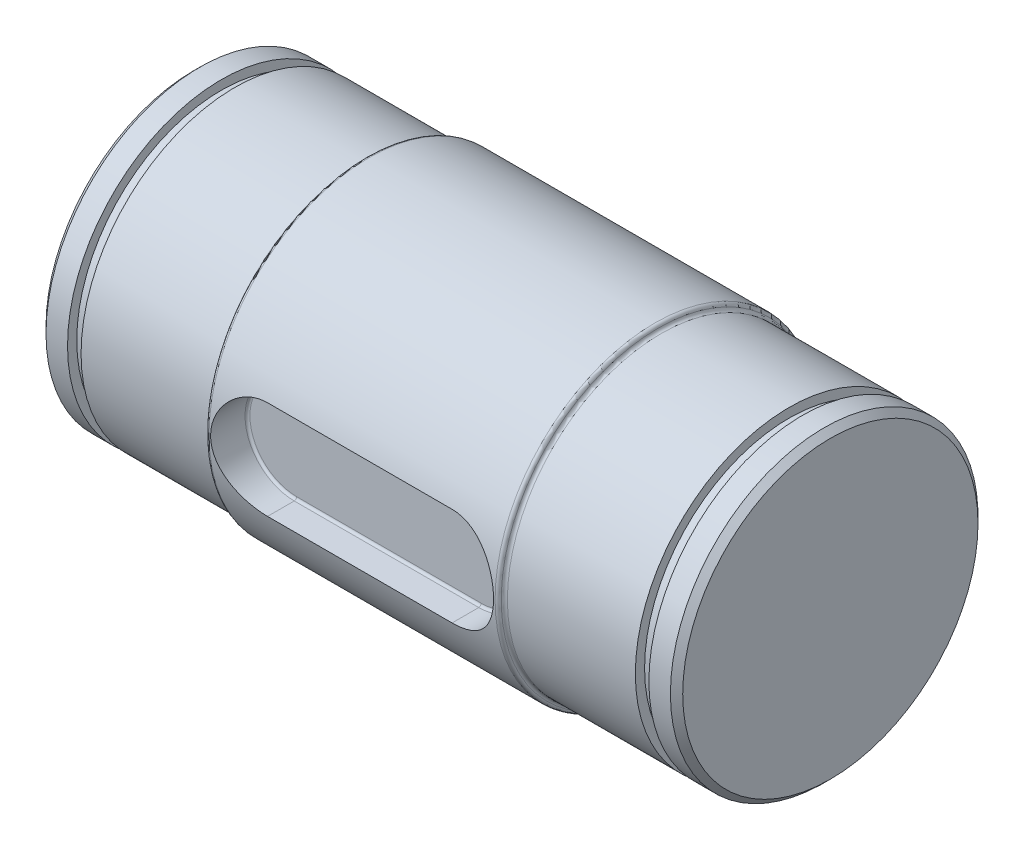
ISO-10303-21;
HEADER;
FILE_DESCRIPTION(('STEP AP214'),'2;1');
FILE_NAME('part.step','',(''),(''),'','','');
FILE_SCHEMA(('AUTOMOTIVE_DESIGN { 1 0 10303 214 1 1 1 1 }'));
ENDSEC;
DATA;
#1=APPLICATION_CONTEXT('core data for automotive mechanical design processes');
#2=APPLICATION_PROTOCOL_DEFINITION('international standard','automotive_design',2000,#1);
#3=PRODUCT_CONTEXT('',#1,'mechanical');
#4=PRODUCT('Part','Part','',(#3));
#5=PRODUCT_RELATED_PRODUCT_CATEGORY('part','',(#4));
#6=PRODUCT_DEFINITION_FORMATION('','',#4);
#7=PRODUCT_DEFINITION_CONTEXT('part definition',#1,'design');
#8=PRODUCT_DEFINITION('design','',#6,#7);
#9=PRODUCT_DEFINITION_SHAPE('','',#8);
#10=(LENGTH_UNIT() NAMED_UNIT(*) SI_UNIT(.MILLI.,.METRE.));
#11=(NAMED_UNIT(*) PLANE_ANGLE_UNIT() SI_UNIT($,.RADIAN.));
#12=(NAMED_UNIT(*) SI_UNIT($,.STERADIAN.) SOLID_ANGLE_UNIT());
#13=UNCERTAINTY_MEASURE_WITH_UNIT(LENGTH_MEASURE(1.E-05),#10,'distance_accuracy_value','');
#14=(GEOMETRIC_REPRESENTATION_CONTEXT(3) GLOBAL_UNCERTAINTY_ASSIGNED_CONTEXT((#13)) GLOBAL_UNIT_ASSIGNED_CONTEXT((#10,
#11,#12)) REPRESENTATION_CONTEXT('',''));
#15=CARTESIAN_POINT('',(0.,0.,0.));
#16=DIRECTION('',(0.,0.,1.));
#17=DIRECTION('',(1.,0.,0.));
#18=AXIS2_PLACEMENT_3D('',#15,#16,#17);
#19=CARTESIAN_POINT('',(51.75,0.,0.));
#20=DIRECTION('',(-1.,0.,0.));
#21=DIRECTION('',(0.,0.,1.));
#22=AXIS2_PLACEMENT_3D('',#19,#20,#21);
#23=PLANE('',#22);
#24=CARTESIAN_POINT('',(51.75,0.,0.));
#25=DIRECTION('',(-1.,0.,0.));
#26=DIRECTION('',(0.,0.,1.));
#27=AXIS2_PLACEMENT_3D('',#24,#25,#26);
#28=CIRCLE('',#27,24.000008612981);
#29=CARTESIAN_POINT('',(51.75,0.,24.000008612981));
#30=VERTEX_POINT('',#29);
#31=EDGE_CURVE('E20',#30,#30,#28,.T.);
#32=ORIENTED_EDGE('',*,*,#31,.F.);
#33=EDGE_LOOP('',(#32));
#34=FACE_BOUND('',#33,.T.);
#35=ADVANCED_FACE('F17',(#34),#23,.F.);
#36=CARTESIAN_POINT('',(-51.75,0.,0.));
#37=DIRECTION('',(-1.,0.,0.));
#38=DIRECTION('',(0.,0.,1.));
#39=AXIS2_PLACEMENT_3D('',#36,#37,#38);
#40=PLANE('',#39);
#41=CARTESIAN_POINT('',(-51.75,0.,1.20553902987361E-13));
#42=DIRECTION('',(-1.,0.,0.));
#43=DIRECTION('',(0.,0.,1.));
#44=AXIS2_PLACEMENT_3D('',#41,#42,#43);
#45=CIRCLE('',#44,24.0000096194053);
#46=CARTESIAN_POINT('',(-51.75,0.,24.0000096194054));
#47=VERTEX_POINT('',#46);
#48=EDGE_CURVE('E185',#47,#47,#45,.F.);
#49=ORIENTED_EDGE('',*,*,#48,.F.);
#50=EDGE_LOOP('',(#49));
#51=FACE_BOUND('',#50,.T.);
#52=ADVANCED_FACE('F422',(#51),#40,.T.);
#53=CARTESIAN_POINT('',(50.7500044859261,0.,0.));
#54=DIRECTION('',(-1.,0.,0.));
#55=DIRECTION('',(0.,0.,1.));
#56=AXIS2_PLACEMENT_3D('',#53,#54,#55);
#57=CONICAL_SURFACE('',#56,25.0000044859245,0.785398342833002);
#58=ORIENTED_EDGE('',*,*,#31,.T.);
#59=EDGE_LOOP('',(#58));
#60=FACE_BOUND('',#59,.T.);
#61=CARTESIAN_POINT('',(50.7500044865,0.,0.));
#62=DIRECTION('',(-1.,0.,0.));
#63=DIRECTION('',(0.,0.,1.));
#64=AXIS2_PLACEMENT_3D('',#61,#62,#63);
#65=CIRCLE('',#64,25.);
#66=CARTESIAN_POINT('',(50.7500044865,0.,25.));
#67=VERTEX_POINT('',#66);
#68=EDGE_CURVE('E181',#67,#67,#65,.T.);
#69=ORIENTED_EDGE('',*,*,#68,.F.);
#70=EDGE_LOOP('',(#69));
#71=FACE_BOUND('',#70,.T.);
#72=ADVANCED_FACE('F414',(#60,#71),#57,.T.);
#73=CARTESIAN_POINT('',(-50.7500050101063,0.,1.20301066671185E-13));
#74=DIRECTION('',(1.,0.,0.));
#75=DIRECTION('',(0.,0.,-1.));
#76=AXIS2_PLACEMENT_3D('',#73,#74,#75);
#77=CONICAL_SURFACE('',#76,25.0000050101042,0.785398363801);
#78=CARTESIAN_POINT('',(-50.7500100202085,0.,1.20301065975894E-13));
#79=DIRECTION('',(1.,0.,0.));
#80=DIRECTION('',(0.,0.,-1.));
#81=AXIS2_PLACEMENT_3D('',#78,#79,#80);
#82=CIRCLE('',#81,25.);
#83=CARTESIAN_POINT('',(-50.7500100202085,0.,-24.9999999999999));
#84=VERTEX_POINT('',#83);
#85=EDGE_CURVE('E184',#84,#84,#82,.T.);
#86=ORIENTED_EDGE('',*,*,#85,.F.);
#87=EDGE_LOOP('',(#86));
#88=FACE_BOUND('',#87,.T.);
#89=ORIENTED_EDGE('',*,*,#48,.T.);
#90=EDGE_LOOP('',(#89));
#91=FACE_BOUND('',#90,.T.);
#92=ADVANCED_FACE('F406',(#88,#91),#77,.T.);
#93=CARTESIAN_POINT('',(56.925,0.,0.));
#94=DIRECTION('',(-1.,0.,0.));
#95=DIRECTION('',(0.,0.,1.));
#96=AXIS2_PLACEMENT_3D('',#93,#94,#95);
#97=CYLINDRICAL_SURFACE('',#96,25.);
#98=CARTESIAN_POINT('',(47.25,0.,0.));
#99=DIRECTION('',(-1.,0.,0.));
#100=DIRECTION('',(0.,0.,1.));
#101=AXIS2_PLACEMENT_3D('',#98,#99,#100);
#102=CIRCLE('',#101,25.);
#103=CARTESIAN_POINT('',(47.25,0.,25.));
#104=VERTEX_POINT('',#103);
#105=EDGE_CURVE('E524',#104,#104,#102,.T.);
#106=ORIENTED_EDGE('',*,*,#105,.F.);
#107=EDGE_LOOP('',(#106));
#108=FACE_BOUND('',#107,.T.);
#109=ORIENTED_EDGE('',*,*,#68,.T.);
#110=EDGE_LOOP('',(#109));
#111=FACE_BOUND('',#110,.T.);
#112=ADVANCED_FACE('F398',(#108,#111),#97,.T.);
#113=CARTESIAN_POINT('',(56.925,0.,0.));
#114=DIRECTION('',(-1.,0.,0.));
#115=DIRECTION('',(0.,0.,1.));
#116=AXIS2_PLACEMENT_3D('',#113,#114,#115);
#117=CYLINDRICAL_SURFACE('',#116,25.);
#118=CARTESIAN_POINT('',(-47.25,0.,0.));
#119=DIRECTION('',(-1.,0.,0.));
#120=DIRECTION('',(0.,0.,1.));
#121=AXIS2_PLACEMENT_3D('',#118,#119,#120);
#122=CIRCLE('',#121,25.);
#123=CARTESIAN_POINT('',(-47.25,0.,25.));
#124=VERTEX_POINT('',#123);
#125=EDGE_CURVE('E527',#124,#124,#122,.T.);
#126=ORIENTED_EDGE('',*,*,#125,.T.);
#127=EDGE_LOOP('',(#126));
#128=FACE_BOUND('',#127,.T.);
#129=ORIENTED_EDGE('',*,*,#85,.T.);
#130=EDGE_LOOP('',(#129));
#131=FACE_BOUND('',#130,.T.);
#132=ADVANCED_FACE('F390',(#128,#131),#117,.T.);
#133=CARTESIAN_POINT('',(47.25,0.,0.));
#134=DIRECTION('',(-1.,0.,0.));
#135=DIRECTION('',(0.,0.,1.));
#136=AXIS2_PLACEMENT_3D('',#133,#134,#135);
#137=PLANE('',#136);
#138=CARTESIAN_POINT('',(47.25,0.,0.));
#139=DIRECTION('',(-1.,0.,0.));
#140=DIRECTION('',(0.,0.,1.));
#141=AXIS2_PLACEMENT_3D('',#138,#139,#140);
#142=CIRCLE('',#141,23.5);
#143=CARTESIAN_POINT('',(47.25,0.,23.5));
#144=VERTEX_POINT('',#143);
#145=EDGE_CURVE('E530',#144,#144,#142,.T.);
#146=ORIENTED_EDGE('',*,*,#145,.F.);
#147=EDGE_LOOP('',(#146));
#148=FACE_BOUND('',#147,.T.);
#149=ORIENTED_EDGE('',*,*,#105,.T.);
#150=EDGE_LOOP('',(#149));
#151=FACE_BOUND('',#150,.T.);
#152=ADVANCED_FACE('F382',(#148,#151),#137,.T.);
#153=CARTESIAN_POINT('',(-47.25,0.,0.));
#154=DIRECTION('',(-1.,0.,0.));
#155=DIRECTION('',(0.,0.,1.));
#156=AXIS2_PLACEMENT_3D('',#153,#154,#155);
#157=PLANE('',#156);
#158=CARTESIAN_POINT('',(-47.25,0.,0.));
#159=DIRECTION('',(-1.,0.,0.));
#160=DIRECTION('',(0.,0.,1.));
#161=AXIS2_PLACEMENT_3D('',#158,#159,#160);
#162=CIRCLE('',#161,23.5);
#163=CARTESIAN_POINT('',(-47.25,0.,23.5));
#164=VERTEX_POINT('',#163);
#165=EDGE_CURVE('E533',#164,#164,#162,.F.);
#166=ORIENTED_EDGE('',*,*,#165,.F.);
#167=EDGE_LOOP('',(#166));
#168=FACE_BOUND('',#167,.T.);
#169=ORIENTED_EDGE('',*,*,#125,.F.);
#170=EDGE_LOOP('',(#169));
#171=FACE_BOUND('',#170,.T.);
#172=ADVANCED_FACE('F374',(#168,#171),#157,.F.);
#173=CARTESIAN_POINT('',(56.925,0.,0.));
#174=DIRECTION('',(-1.,0.,0.));
#175=DIRECTION('',(0.,0.,1.));
#176=AXIS2_PLACEMENT_3D('',#173,#174,#175);
#177=CYLINDRICAL_SURFACE('',#176,23.5);
#178=CARTESIAN_POINT('',(45.05,0.,0.));
#179=DIRECTION('',(-1.,0.,0.));
#180=DIRECTION('',(0.,0.,1.));
#181=AXIS2_PLACEMENT_3D('',#178,#179,#180);
#182=CIRCLE('',#181,23.5);
#183=CARTESIAN_POINT('',(45.05,0.,23.5));
#184=VERTEX_POINT('',#183);
#185=EDGE_CURVE('E536',#184,#184,#182,.F.);
#186=ORIENTED_EDGE('',*,*,#185,.T.);
#187=EDGE_LOOP('',(#186));
#188=FACE_BOUND('',#187,.T.);
#189=ORIENTED_EDGE('',*,*,#145,.T.);
#190=EDGE_LOOP('',(#189));
#191=FACE_BOUND('',#190,.T.);
#192=ADVANCED_FACE('F366',(#188,#191),#177,.T.);
#193=CARTESIAN_POINT('',(56.925,0.,0.));
#194=DIRECTION('',(-1.,0.,0.));
#195=DIRECTION('',(0.,0.,1.));
#196=AXIS2_PLACEMENT_3D('',#193,#194,#195);
#197=CYLINDRICAL_SURFACE('',#196,23.5);
#198=ORIENTED_EDGE('',*,*,#165,.T.);
#199=EDGE_LOOP('',(#198));
#200=FACE_BOUND('',#199,.T.);
#201=CARTESIAN_POINT('',(-45.05,0.,0.));
#202=DIRECTION('',(-1.,0.,0.));
#203=DIRECTION('',(0.,0.,1.));
#204=AXIS2_PLACEMENT_3D('',#201,#202,#203);
#205=CIRCLE('',#204,23.5);
#206=CARTESIAN_POINT('',(-45.05,0.,23.5));
#207=VERTEX_POINT('',#206);
#208=EDGE_CURVE('E539',#207,#207,#205,.F.);
#209=ORIENTED_EDGE('',*,*,#208,.F.);
#210=EDGE_LOOP('',(#209));
#211=FACE_BOUND('',#210,.T.);
#212=ADVANCED_FACE('F358',(#200,#211),#197,.T.);
#213=CARTESIAN_POINT('',(45.05,0.,0.));
#214=DIRECTION('',(-1.,0.,0.));
#215=DIRECTION('',(0.,0.,1.));
#216=AXIS2_PLACEMENT_3D('',#213,#214,#215);
#217=PLANE('',#216);
#218=ORIENTED_EDGE('',*,*,#185,.F.);
#219=EDGE_LOOP('',(#218));
#220=FACE_BOUND('',#219,.T.);
#221=CARTESIAN_POINT('',(45.05,0.,0.));
#222=DIRECTION('',(-1.,0.,0.));
#223=DIRECTION('',(0.,0.,1.));
#224=AXIS2_PLACEMENT_3D('',#221,#222,#223);
#225=CIRCLE('',#224,25.);
#226=CARTESIAN_POINT('',(45.05,0.,25.));
#227=VERTEX_POINT('',#226);
#228=EDGE_CURVE('E89',#227,#227,#225,.T.);
#229=ORIENTED_EDGE('',*,*,#228,.F.);
#230=EDGE_LOOP('',(#229));
#231=FACE_BOUND('',#230,.T.);
#232=ADVANCED_FACE('F350',(#220,#231),#217,.F.);
#233=CARTESIAN_POINT('',(-45.05,0.,0.));
#234=DIRECTION('',(-1.,0.,0.));
#235=DIRECTION('',(0.,0.,1.));
#236=AXIS2_PLACEMENT_3D('',#233,#234,#235);
#237=PLANE('',#236);
#238=ORIENTED_EDGE('',*,*,#208,.T.);
#239=EDGE_LOOP('',(#238));
#240=FACE_BOUND('',#239,.T.);
#241=CARTESIAN_POINT('',(-45.05,0.,0.));
#242=DIRECTION('',(-1.,0.,0.));
#243=DIRECTION('',(0.,0.,1.));
#244=AXIS2_PLACEMENT_3D('',#241,#242,#243);
#245=CIRCLE('',#244,25.);
#246=CARTESIAN_POINT('',(-45.05,0.,25.));
#247=VERTEX_POINT('',#246);
#248=EDGE_CURVE('E88',#247,#247,#245,.F.);
#249=ORIENTED_EDGE('',*,*,#248,.F.);
#250=EDGE_LOOP('',(#249));
#251=FACE_BOUND('',#250,.T.);
#252=ADVANCED_FACE('F342',(#240,#251),#237,.T.);
#253=CARTESIAN_POINT('',(56.925,0.,0.));
#254=DIRECTION('',(-1.,0.,0.));
#255=DIRECTION('',(0.,0.,1.));
#256=AXIS2_PLACEMENT_3D('',#253,#254,#255);
#257=CYLINDRICAL_SURFACE('',#256,25.);
#258=ORIENTED_EDGE('',*,*,#228,.T.);
#259=EDGE_LOOP('',(#258));
#260=FACE_BOUND('',#259,.T.);
#261=CARTESIAN_POINT('',(24.25,0.,0.));
#262=DIRECTION('',(-1.,0.,0.));
#263=DIRECTION('',(0.,1.,-5.23143334208E-12));
#264=AXIS2_PLACEMENT_3D('',#261,#262,#263);
#265=CIRCLE('',#264,25.);
#266=CARTESIAN_POINT('',(24.25,25.,-1.30776526629399E-10));
#267=VERTEX_POINT('',#266);
#268=EDGE_CURVE('E178',#267,#267,#265,.F.);
#269=ORIENTED_EDGE('',*,*,#268,.T.);
#270=EDGE_LOOP('',(#269));
#271=FACE_BOUND('',#270,.T.);
#272=ADVANCED_FACE('F336',(#260,#271),#257,.T.);
#273=CARTESIAN_POINT('',(0.,0.,20.));
#274=DIRECTION('',(0.,0.,1.));
#275=DIRECTION('',(1.,0.,0.));
#276=AXIS2_PLACEMENT_3D('',#273,#274,#275);
#277=PLANE('',#276);
#278=DIRECTION('',(1.,0.,0.));
#279=VECTOR('',#278,1.);
#280=CARTESIAN_POINT('',(-15.2773739955,7.6,20.));
#281=LINE('',#280,#279);
#282=CARTESIAN_POINT('',(15.,7.6,20.));
#283=VERTEX_POINT('',#282);
#284=CARTESIAN_POINT('',(-15.,7.6,20.));
#285=VERTEX_POINT('',#284);
#286=EDGE_CURVE('E77',#283,#285,#281,.F.);
#287=ORIENTED_EDGE('',*,*,#286,.T.);
#288=CARTESIAN_POINT('',(-15.,0.,20.));
#289=DIRECTION('',(0.,0.,-1.));
#290=DIRECTION('',(0.,-1.,0.));
#291=AXIS2_PLACEMENT_3D('',#288,#289,#290);
#292=CIRCLE('',#291,7.6);
#293=CARTESIAN_POINT('',(-15.,-7.6,20.));
#294=VERTEX_POINT('',#293);
#295=EDGE_CURVE('E81',#285,#294,#292,.F.);
#296=ORIENTED_EDGE('',*,*,#295,.T.);
#297=DIRECTION('',(-1.,0.,0.));
#298=VECTOR('',#297,1.);
#299=CARTESIAN_POINT('',(15.2773739955,-7.6,20.));
#300=LINE('',#299,#298);
#301=CARTESIAN_POINT('',(15.,-7.6,20.));
#302=VERTEX_POINT('',#301);
#303=EDGE_CURVE('E144',#294,#302,#300,.F.);
#304=ORIENTED_EDGE('',*,*,#303,.T.);
#305=CARTESIAN_POINT('',(15.,0.,20.));
#306=DIRECTION('',(0.,0.,-1.));
#307=DIRECTION('',(0.,1.,0.));
#308=AXIS2_PLACEMENT_3D('',#305,#306,#307);
#309=CIRCLE('',#308,7.6);
#310=EDGE_CURVE('E84',#302,#283,#309,.F.);
#311=ORIENTED_EDGE('',*,*,#310,.T.);
#312=EDGE_LOOP('',(#287,#296,#304,#311));
#313=FACE_BOUND('',#312,.T.);
#314=ADVANCED_FACE('F79',(#313),#277,.T.);
#315=CARTESIAN_POINT('',(-15.2773739955,7.6,20.4));
#316=DIRECTION('',(1.,0.,0.));
#317=DIRECTION('',(0.,0.,-1.));
#318=AXIS2_PLACEMENT_3D('',#315,#316,#317);
#319=CYLINDRICAL_SURFACE('',#318,0.4);
#320=DIRECTION('',(1.,0.,0.));
#321=VECTOR('',#320,1.);
#322=CARTESIAN_POINT('',(15.,8.,20.4));
#323=LINE('',#322,#321);
#324=CARTESIAN_POINT('',(15.,8.,20.4));
#325=VERTEX_POINT('',#324);
#326=CARTESIAN_POINT('',(-15.,8.,20.4));
#327=VERTEX_POINT('',#326);
#328=EDGE_CURVE('E95',#325,#327,#323,.F.);
#329=ORIENTED_EDGE('',*,*,#328,.T.);
#330=CARTESIAN_POINT('',(-15.,7.6,20.4));
#331=DIRECTION('',(-1.,0.,0.));
#332=DIRECTION('',(0.,1.,0.));
#333=AXIS2_PLACEMENT_3D('',#330,#331,#332);
#334=CIRCLE('',#333,0.4);
#335=EDGE_CURVE('E92',#327,#285,#334,.T.);
#336=ORIENTED_EDGE('',*,*,#335,.T.);
#337=ORIENTED_EDGE('',*,*,#286,.F.);
#338=CARTESIAN_POINT('',(15.,7.6,20.4));
#339=DIRECTION('',(-1.,0.,0.));
#340=DIRECTION('',(0.,1.,0.));
#341=AXIS2_PLACEMENT_3D('',#338,#339,#340);
#342=CIRCLE('',#341,0.4);
#343=EDGE_CURVE('E149',#283,#325,#342,.F.);
#344=ORIENTED_EDGE('',*,*,#343,.T.);
#345=EDGE_LOOP('',(#329,#336,#337,#344));
#346=FACE_BOUND('',#345,.T.);
#347=ADVANCED_FACE('F93',(#346),#319,.F.);
#348=CARTESIAN_POINT('',(56.925,0.,0.));
#349=DIRECTION('',(-1.,0.,0.));
#350=DIRECTION('',(0.,0.,1.));
#351=AXIS2_PLACEMENT_3D('',#348,#349,#350);
#352=CYLINDRICAL_SURFACE('',#351,25.);
#353=ORIENTED_EDGE('',*,*,#248,.T.);
#354=EDGE_LOOP('',(#353));
#355=FACE_BOUND('',#354,.T.);
#356=CARTESIAN_POINT('',(-24.25,0.,0.));
#357=DIRECTION('',(-1.,0.,0.));
#358=DIRECTION('',(0.,1.,9.13429921978E-13));
#359=AXIS2_PLACEMENT_3D('',#356,#357,#358);
#360=CIRCLE('',#359,25.);
#361=CARTESIAN_POINT('',(-24.25,25.,2.28391156312348E-11));
#362=VERTEX_POINT('',#361);
#363=EDGE_CURVE('E175',#362,#362,#360,.T.);
#364=ORIENTED_EDGE('',*,*,#363,.T.);
#365=EDGE_LOOP('',(#364));
#366=FACE_BOUND('',#365,.T.);
#367=ADVANCED_FACE('F317',(#355,#366),#352,.T.);
#368=CARTESIAN_POINT('',(24.25,0.,0.));
#369=DIRECTION('',(-1.,0.,0.));
#370=DIRECTION('',(0.,1.,-5.23143334208E-12));
#371=AXIS2_PLACEMENT_3D('',#368,#369,#370);
#372=TOROIDAL_SURFACE('',#371,25.5,0.5);
#373=ORIENTED_EDGE('',*,*,#268,.F.);
#374=EDGE_LOOP('',(#373));
#375=FACE_BOUND('',#374,.T.);
#376=CARTESIAN_POINT('',(23.75,0.,0.));
#377=DIRECTION('',(-1.,0.,0.));
#378=DIRECTION('',(0.,1.,-1.54597272484E-11));
#379=AXIS2_PLACEMENT_3D('',#376,#377,#378);
#380=CIRCLE('',#379,25.5);
#381=CARTESIAN_POINT('',(23.75,25.5,-3.94213799141917E-10));
#382=VERTEX_POINT('',#381);
#383=EDGE_CURVE('E140',#382,#382,#380,.T.);
#384=ORIENTED_EDGE('',*,*,#383,.F.);
#385=EDGE_LOOP('',(#384));
#386=FACE_BOUND('',#385,.T.);
#387=ADVANCED_FACE('F155',(#375,#386),#372,.F.);
#388=CARTESIAN_POINT('',(15.,0.,20.4));
#389=DIRECTION('',(0.,0.,1.));
#390=DIRECTION('',(-1.,-1.01712284428E-10,0.));
#391=AXIS2_PLACEMENT_3D('',#388,#389,#390);
#392=TOROIDAL_SURFACE('',#391,7.6,0.4);
#393=CARTESIAN_POINT('',(15.,0.,20.4));
#394=DIRECTION('',(0.,0.,1.));
#395=DIRECTION('',(1.,0.,0.));
#396=AXIS2_PLACEMENT_3D('',#393,#394,#395);
#397=CIRCLE('',#396,8.);
#398=CARTESIAN_POINT('',(15.,-8.,20.4));
#399=VERTEX_POINT('',#398);
#400=EDGE_CURVE('E136',#399,#325,#397,.T.);
#401=ORIENTED_EDGE('',*,*,#400,.T.);
#402=ORIENTED_EDGE('',*,*,#343,.F.);
#403=ORIENTED_EDGE('',*,*,#310,.F.);
#404=CARTESIAN_POINT('',(15.,-7.6,20.4));
#405=DIRECTION('',(-1.,0.,0.));
#406=DIRECTION('',(0.,0.,1.));
#407=AXIS2_PLACEMENT_3D('',#404,#405,#406);
#408=CIRCLE('',#407,0.4);
#409=EDGE_CURVE('E101',#302,#399,#408,.T.);
#410=ORIENTED_EDGE('',*,*,#409,.T.);
#411=EDGE_LOOP('',(#401,#402,#403,#410));
#412=FACE_BOUND('',#411,.T.);
#413=ADVANCED_FACE('F151',(#412),#392,.F.);
#414=CARTESIAN_POINT('',(15.2773739955,-7.6,20.4));
#415=DIRECTION('',(-1.,0.,0.));
#416=DIRECTION('',(0.,0.,1.));
#417=AXIS2_PLACEMENT_3D('',#414,#415,#416);
#418=CYLINDRICAL_SURFACE('',#417,0.4);
#419=DIRECTION('',(1.,0.,0.));
#420=VECTOR('',#419,1.);
#421=CARTESIAN_POINT('',(-15.,-8.,20.4));
#422=LINE('',#421,#420);
#423=CARTESIAN_POINT('',(-15.,-8.,20.4));
#424=VERTEX_POINT('',#423);
#425=EDGE_CURVE('E225',#424,#399,#422,.T.);
#426=ORIENTED_EDGE('',*,*,#425,.T.);
#427=ORIENTED_EDGE('',*,*,#409,.F.);
#428=ORIENTED_EDGE('',*,*,#303,.F.);
#429=CARTESIAN_POINT('',(-15.,-7.6,20.4));
#430=DIRECTION('',(1.,0.,0.));
#431=DIRECTION('',(0.,-1.,0.));
#432=AXIS2_PLACEMENT_3D('',#429,#430,#431);
#433=CIRCLE('',#432,0.4);
#434=EDGE_CURVE('E56',#294,#424,#433,.F.);
#435=ORIENTED_EDGE('',*,*,#434,.T.);
#436=EDGE_LOOP('',(#426,#427,#428,#435));
#437=FACE_BOUND('',#436,.T.);
#438=ADVANCED_FACE('F123',(#437),#418,.F.);
#439=CARTESIAN_POINT('',(-15.,0.,20.4));
#440=DIRECTION('',(0.,0.,1.));
#441=DIRECTION('',(1.,1.01712520351E-10,0.));
#442=AXIS2_PLACEMENT_3D('',#439,#440,#441);
#443=TOROIDAL_SURFACE('',#442,7.6,0.4);
#444=CARTESIAN_POINT('',(-15.,0.,20.4));
#445=DIRECTION('',(0.,0.,1.));
#446=DIRECTION('',(1.,0.,0.));
#447=AXIS2_PLACEMENT_3D('',#444,#445,#446);
#448=CIRCLE('',#447,8.);
#449=EDGE_CURVE('E220',#327,#424,#448,.T.);
#450=ORIENTED_EDGE('',*,*,#449,.T.);
#451=ORIENTED_EDGE('',*,*,#434,.F.);
#452=ORIENTED_EDGE('',*,*,#295,.F.);
#453=ORIENTED_EDGE('',*,*,#335,.F.);
#454=EDGE_LOOP('',(#450,#451,#452,#453));
#455=FACE_BOUND('',#454,.T.);
#456=ADVANCED_FACE('F100',(#455),#443,.F.);
#457=CARTESIAN_POINT('',(15.,8.,26.));
#458=DIRECTION('',(0.,1.,0.));
#459=DIRECTION('',(0.,0.,1.));
#460=AXIS2_PLACEMENT_3D('',#457,#458,#459);
#461=PLANE('',#460);
#462=DIRECTION('',(-1.,0.,0.));
#463=VECTOR('',#462,1.);
#464=CARTESIAN_POINT('',(56.925,8.00000000000175,24.7386337537054));
#465=LINE('',#464,#463);
#466=CARTESIAN_POINT('',(-15.,8.00000000000087,24.7386337537057));
#467=VERTEX_POINT('',#466);
#468=CARTESIAN_POINT('',(15.,8.00000000000087,24.7386337537057));
#469=VERTEX_POINT('',#468);
#470=EDGE_CURVE('E174',#467,#469,#465,.F.);
#471=ORIENTED_EDGE('',*,*,#470,.F.);
#472=DIRECTION('',(0.,0.,1.));
#473=VECTOR('',#472,1.);
#474=CARTESIAN_POINT('',(-15.,8.,26.));
#475=LINE('',#474,#473);
#476=EDGE_CURVE('E171',#467,#327,#475,.F.);
#477=ORIENTED_EDGE('',*,*,#476,.T.);
#478=ORIENTED_EDGE('',*,*,#328,.F.);
#479=DIRECTION('',(0.,0.,1.));
#480=VECTOR('',#479,1.);
#481=CARTESIAN_POINT('',(15.,8.,26.));
#482=LINE('',#481,#480);
#483=EDGE_CURVE('E139',#325,#469,#482,.T.);
#484=ORIENTED_EDGE('',*,*,#483,.T.);
#485=EDGE_LOOP('',(#471,#477,#478,#484));
#486=FACE_BOUND('',#485,.T.);
#487=ADVANCED_FACE('F122',(#486),#461,.F.);
#488=CARTESIAN_POINT('',(-24.25,0.,0.));
#489=DIRECTION('',(-1.,0.,0.));
#490=DIRECTION('',(0.,1.,9.13429921978E-13));
#491=AXIS2_PLACEMENT_3D('',#488,#489,#490);
#492=TOROIDAL_SURFACE('',#491,25.5,0.5);
#493=ORIENTED_EDGE('',*,*,#363,.F.);
#494=EDGE_LOOP('',(#493));
#495=FACE_BOUND('',#494,.T.);
#496=CARTESIAN_POINT('',(-23.75,0.,0.));
#497=DIRECTION('',(-1.,0.,0.));
#498=DIRECTION('',(0.,1.,-1.28839057478E-11));
#499=AXIS2_PLACEMENT_3D('',#496,#497,#498);
#500=CIRCLE('',#499,25.5);
#501=CARTESIAN_POINT('',(-23.75,25.5,-3.28536167756797E-10));
#502=VERTEX_POINT('',#501);
#503=EDGE_CURVE('E162',#502,#502,#500,.F.);
#504=ORIENTED_EDGE('',*,*,#503,.F.);
#505=EDGE_LOOP('',(#504));
#506=FACE_BOUND('',#505,.T.);
#507=ADVANCED_FACE('F238',(#495,#506),#492,.F.);
#508=CARTESIAN_POINT('',(23.25,0.,0.));
#509=DIRECTION('',(-1.,0.,0.));
#510=DIRECTION('',(0.,1.,-1.54597272484E-11));
#511=AXIS2_PLACEMENT_3D('',#508,#509,#510);
#512=TOROIDAL_SURFACE('',#511,25.5,0.5);
#513=ORIENTED_EDGE('',*,*,#383,.T.);
#514=EDGE_LOOP('',(#513));
#515=FACE_BOUND('',#514,.T.);
#516=CARTESIAN_POINT('',(23.25,0.,0.));
#517=DIRECTION('',(-1.,0.,0.));
#518=DIRECTION('',(0.,0.,1.));
#519=AXIS2_PLACEMENT_3D('',#516,#517,#518);
#520=CIRCLE('',#519,26.);
#521=CARTESIAN_POINT('',(23.25,0.,26.));
#522=VERTEX_POINT('',#521);
#523=EDGE_CURVE('E170',#522,#522,#520,.T.);
#524=ORIENTED_EDGE('',*,*,#523,.F.);
#525=EDGE_LOOP('',(#524));
#526=FACE_BOUND('',#525,.T.);
#527=ADVANCED_FACE('F235',(#515,#526),#512,.T.);
#528=CARTESIAN_POINT('',(15.,0.,26.));
#529=DIRECTION('',(0.,0.,1.));
#530=DIRECTION('',(1.,0.,0.));
#531=AXIS2_PLACEMENT_3D('',#528,#529,#530);
#532=CYLINDRICAL_SURFACE('',#531,8.);
#533=CARTESIAN_POINT('',(15.,8.,24.738633753706));
#534=CARTESIAN_POINT('',(15.2192705588559,8.00003002803162,24.7386012686902));
#535=CARTESIAN_POINT('',(15.4385292011944,7.99098645035781,24.7415479133923));
#536=CARTESIAN_POINT('',(15.8753670754415,7.9549746883724,24.7531621395127));
#537=CARTESIAN_POINT('',(16.0929466893541,7.92801071060019,24.7618283783405));
#538=CARTESIAN_POINT('',(16.5243086661961,7.85647453724807,24.7846147424266));
#539=CARTESIAN_POINT('',(16.7380994947822,7.81194872986761,24.7987204974571));
#540=CARTESIAN_POINT('',(17.1609660171612,7.7056956832938,24.8319425235332));
#541=CARTESIAN_POINT('',(17.3700415773019,7.64396795717979,24.8510589364105));
#542=CARTESIAN_POINT('',(17.7819259738527,7.50387777626658,24.8937173687698));
#543=CARTESIAN_POINT('',(17.9847386151953,7.42552565853958,24.9172566370773));
#544=CARTESIAN_POINT('',(18.3829970861467,7.25275564566746,24.9680924942892));
#545=CARTESIAN_POINT('',(18.5784401491538,7.15833178898069,24.995390476705));
#546=CARTESIAN_POINT('',(18.9607145898912,6.9541146971394,25.0529746731592));
#547=CARTESIAN_POINT('',(19.1475440728055,6.8443181015302,25.0832615401342));
#548=CARTESIAN_POINT('',(19.5114410126458,6.61012270031495,25.1459931100598));
#549=CARTESIAN_POINT('',(19.6885079266419,6.48572308378625,25.1784379328007));
#550=CARTESIAN_POINT('',(20.0369763655414,6.21919710421829,25.2456140569195));
#551=CARTESIAN_POINT('',(20.2080500182667,6.07665181367262,25.2803847217888));
#552=CARTESIAN_POINT('',(20.5376821024352,5.77785117844753,25.3503446706514));
#553=CARTESIAN_POINT('',(20.6962403247892,5.62159560480917,25.3855339616272));
#554=CARTESIAN_POINT('',(20.9998998793105,5.2962935836556,25.4553914397402));
#555=CARTESIAN_POINT('',(21.1449962502721,5.12724246184191,25.4900594308455));
#556=CARTESIAN_POINT('',(21.4207127076744,4.77745129335323,25.5579282045035));
#557=CARTESIAN_POINT('',(21.5513332056527,4.59671157920696,25.5911290287506));
#558=CARTESIAN_POINT('',(21.7999754970546,4.22046376048394,25.6558946570076));
#559=CARTESIAN_POINT('',(21.9176469613182,4.0247146042073,25.6874057186764));
#560=CARTESIAN_POINT('',(22.1359668706181,3.62354913789891,25.7470580360845));
#561=CARTESIAN_POINT('',(22.2366218442432,3.41813657419523,25.7752005829809));
#562=CARTESIAN_POINT('',(22.420055917156,2.99916792684629,25.8273013235358));
#563=CARTESIAN_POINT('',(22.5028503862171,2.78561903261708,25.8512631115037));
#564=CARTESIAN_POINT('',(22.649921354537,2.3518422630008,25.8943308209309));
#565=CARTESIAN_POINT('',(22.7142024835504,2.13161607270256,25.9134379562845));
#566=CARTESIAN_POINT('',(22.8454431758837,1.59741783786105,25.9527560719791));
#567=CARTESIAN_POINT('',(22.903314691152,1.28097205456156,25.9703879749263));
#568=CARTESIAN_POINT('',(22.9805892392786,0.642981149249854,25.9940075673692));
#569=CARTESIAN_POINT('',(22.9999938147905,0.321436232251335,25.999995723818));
#570=CARTESIAN_POINT('',(23.0000042165041,-0.219125510161256,26.0000029151056));
#571=CARTESIAN_POINT('',(22.990993512199,-0.438200511781659,25.9972249702586));
#572=CARTESIAN_POINT('',(22.9550411980609,-0.874802538634958,25.9861956845295));
#573=CARTESIAN_POINT('',(22.9280961769278,-1.09232926141121,25.9779433023514));
#574=CARTESIAN_POINT('',(22.8564928823853,-1.52429991765145,25.9561808535043));
#575=CARTESIAN_POINT('',(22.811824355255,-1.7387419919777,25.9426677433899));
#576=CARTESIAN_POINT('',(22.7051519279833,-2.16298160545598,25.9107463484076));
#577=CARTESIAN_POINT('',(22.6431414905465,-2.37277736085953,25.8923362176617));
#578=CARTESIAN_POINT('',(22.5024729356723,-2.78574605855141,25.8511622754655));
#579=CARTESIAN_POINT('',(22.4238516794593,-2.98893253412193,25.8284081144958));
#580=CARTESIAN_POINT('',(22.2504752944563,-3.38791056183328,25.7791094787746));
#581=CARTESIAN_POINT('',(22.1557141091464,-3.58369930414724,25.7525635817769));
#582=CARTESIAN_POINT('',(21.9508294897242,-3.96649458076771,25.696387547573));
#583=CARTESIAN_POINT('',(21.840712293684,-4.15350464021115,25.6667586640028));
#584=CARTESIAN_POINT('',(21.6058050009658,-4.51777973159953,25.6051520411434));
#585=CARTESIAN_POINT('',(21.4810081783441,-4.69504024145762,25.5731732276961));
#586=CARTESIAN_POINT('',(21.2140598723134,-5.04330052954374,25.506810535743));
#587=CARTESIAN_POINT('',(21.0715321722645,-5.21400410063578,25.4723851217546));
#588=CARTESIAN_POINT('',(20.7728454398206,-5.54288759643121,25.4028473693241));
#589=CARTESIAN_POINT('',(20.6166861545081,-5.70106728866533,25.3677350181461));
#590=CARTESIAN_POINT('',(20.2916530442582,-6.00398016693894,25.2977548558117));
#591=CARTESIAN_POINT('',(20.1227740000993,-6.14870777825165,25.2628871515253));
#592=CARTESIAN_POINT('',(19.7734660827852,-6.42366002689184,25.1943776155279));
#593=CARTESIAN_POINT('',(19.5930415117413,-6.55389001735635,25.1607353344464));
#594=CARTESIAN_POINT('',(19.2171197615747,-6.80204828924933,25.0948008983861));
#595=CARTESIAN_POINT('',(19.021360909541,-6.9195949196792,25.062562350649));
#596=CARTESIAN_POINT('',(18.6201941888317,-7.13766781821739,25.0013304696352));
#597=CARTESIAN_POINT('',(18.4147900283401,-7.23820056005455,24.9723359034637));
#598=CARTESIAN_POINT('',(17.9957675740503,-7.42142942388002,24.9184974100846));
#599=CARTESIAN_POINT('',(17.7821538839746,-7.5041353756095,24.8936511971761));
#600=CARTESIAN_POINT('',(17.3482482024732,-7.65102791649109,24.8488962406672));
#601=CARTESIAN_POINT('',(17.1279579234481,-7.71521921057063,24.8289862428614));
#602=CARTESIAN_POINT('',(16.5942301599398,-7.8460596483451,24.7880189035354));
#603=CARTESIAN_POINT('',(16.2782991052981,-7.90370673421533,24.769601964515));
#604=CARTESIAN_POINT('',(15.8008563566974,-7.96143261955182,24.7510794702751));
#605=CARTESIAN_POINT('',(15.6411049269818,-7.97588379664448,24.7464224496472));
#606=CARTESIAN_POINT('',(15.3209198755068,-7.99516840004497,24.7401968703129));
#607=CARTESIAN_POINT('',(15.1604860825557,-7.9999992503679,24.7386291388106));
#608=CARTESIAN_POINT('',(15.,-8.,24.738633753706));
#609=B_SPLINE_CURVE_WITH_KNOTS('',3,(#533,#534,#535,#536,#537,#538,#539,#540,#541,#542,#543,
#544,#545,#546,#547,#548,#549,#550,#551,#552,#553,#554,#555,#556,#557,#558,#559,#560,#561,#562,
#563,#564,#565,#566,#567,#568,#569,#570,#571,#572,#573,#574,#575,#576,#577,#578,#579,#580,#581,
#582,#583,#584,#585,#586,#587,#588,#589,#590,#591,#592,#593,#594,#595,#596,#597,#598,#599,#600,
#601,#602,#603,#604,#605,#606,#607,#608),.UNSPECIFIED.,.F.,.F.,(4,2,2,2,2,2,2,2,2,2,2,2,2,2,2,2,
2,2,2,2,2,2,2,2,2,2,2,2,2,2,2,2,2,2,2,2,2,4),(0.,0.65758707979216,1.3150198555843,
1.97072758041263,2.62645386770949,3.28177361207427,3.93733696815623,4.59304385367027,
5.24878716858773,5.92414436682801,6.59951284554364,7.27512924276037,7.9507264278169,
8.64155129592295,9.33211051598308,10.0220730867704,10.7118629638922,11.675785987273,
12.6396703533204,13.2967576143527,13.9539698961855,14.6115629559641,15.2694042403123,
15.9258007543949,16.5824441266129,17.2388215234714,17.8955008408859,18.5698251206807,
19.2441619144047,19.9187769280671,20.5931420131763,21.2841043716796,21.9748032272707,
22.6651202497546,23.3552616946565,24.3173998928687,24.7985453681027,25.2798196598466),.UNSPECIFIED.);
#610=CARTESIAN_POINT('',(15.,-8.00000000000088,24.7386337537057));
#611=VERTEX_POINT('',#610);
#612=EDGE_CURVE('E193',#469,#611,#609,.T.);
#613=ORIENTED_EDGE('',*,*,#612,.F.);
#614=ORIENTED_EDGE('',*,*,#483,.F.);
#615=ORIENTED_EDGE('',*,*,#400,.F.);
#616=DIRECTION('',(0.,0.,-1.));
#617=VECTOR('',#616,1.);
#618=CARTESIAN_POINT('',(15.,-8.,26.));
#619=LINE('',#618,#617);
#620=EDGE_CURVE('E223',#399,#611,#619,.F.);
#621=ORIENTED_EDGE('',*,*,#620,.T.);
#622=EDGE_LOOP('',(#613,#614,#615,#621));
#623=FACE_BOUND('',#622,.T.);
#624=ADVANCED_FACE('F237',(#623),#532,.F.);
#625=CARTESIAN_POINT('',(-15.,-8.,26.));
#626=DIRECTION('',(0.,-1.,0.));
#627=DIRECTION('',(0.,0.,-1.));
#628=AXIS2_PLACEMENT_3D('',#625,#626,#627);
#629=PLANE('',#628);
#630=DIRECTION('',(-1.,0.,0.));
#631=VECTOR('',#630,1.);
#632=CARTESIAN_POINT('',(56.925,-8.00000000000176,24.7386337537054));
#633=LINE('',#632,#631);
#634=CARTESIAN_POINT('',(-15.,-8.00000000000044,24.7386337537057));
#635=VERTEX_POINT('',#634);
#636=EDGE_CURVE('E192',#611,#635,#633,.T.);
#637=ORIENTED_EDGE('',*,*,#636,.F.);
#638=ORIENTED_EDGE('',*,*,#620,.F.);
#639=ORIENTED_EDGE('',*,*,#425,.F.);
#640=DIRECTION('',(0.,0.,1.));
#641=VECTOR('',#640,1.);
#642=CARTESIAN_POINT('',(-15.,-8.,26.));
#643=LINE('',#642,#641);
#644=EDGE_CURVE('E35',#424,#635,#643,.T.);
#645=ORIENTED_EDGE('',*,*,#644,.T.);
#646=EDGE_LOOP('',(#637,#638,#639,#645));
#647=FACE_BOUND('',#646,.T.);
#648=ADVANCED_FACE('F257',(#647),#629,.F.);
#649=CARTESIAN_POINT('',(-15.,0.,26.));
#650=DIRECTION('',(0.,0.,1.));
#651=DIRECTION('',(1.,0.,0.));
#652=AXIS2_PLACEMENT_3D('',#649,#650,#651);
#653=CYLINDRICAL_SURFACE('',#652,8.);
#654=ORIENTED_EDGE('',*,*,#476,.F.);
#655=CARTESIAN_POINT('',(-15.,-8.,24.738633753706));
#656=CARTESIAN_POINT('',(-15.2192705588559,-8.00003002803162,24.7386012686902));
#657=CARTESIAN_POINT('',(-15.4385292011944,-7.99098645035781,24.7415479133923));
#658=CARTESIAN_POINT('',(-15.8753670754415,-7.9549746883724,24.7531621395127));
#659=CARTESIAN_POINT('',(-16.0929466893541,-7.92801071060019,24.7618283783405));
#660=CARTESIAN_POINT('',(-16.5243086661961,-7.85647453724807,24.7846147424266));
#661=CARTESIAN_POINT('',(-16.7380994947822,-7.81194872986761,24.7987204974571));
#662=CARTESIAN_POINT('',(-17.1609660171612,-7.7056956832938,24.8319425235332));
#663=CARTESIAN_POINT('',(-17.3700415773019,-7.64396795717979,24.8510589364105));
#664=CARTESIAN_POINT('',(-17.7819259738527,-7.50387777626658,24.8937173687698));
#665=CARTESIAN_POINT('',(-17.9847386151953,-7.42552565853958,24.9172566370773));
#666=CARTESIAN_POINT('',(-18.3829970861467,-7.25275564566746,24.9680924942892));
#667=CARTESIAN_POINT('',(-18.5784401491538,-7.15833178898069,24.995390476705));
#668=CARTESIAN_POINT('',(-18.9607145898912,-6.9541146971394,25.0529746731591));
#669=CARTESIAN_POINT('',(-19.1475440728055,-6.8443181015302,25.0832615401342));
#670=CARTESIAN_POINT('',(-19.5114410126458,-6.61012270031495,25.1459931100598));
#671=CARTESIAN_POINT('',(-19.6885079266419,-6.48572308378625,25.1784379328007));
#672=CARTESIAN_POINT('',(-20.0369763655414,-6.21919710421829,25.2456140569195));
#673=CARTESIAN_POINT('',(-20.2080500182667,-6.07665181367262,25.2803847217888));
#674=CARTESIAN_POINT('',(-20.5376821024352,-5.77785117844753,25.3503446706514));
#675=CARTESIAN_POINT('',(-20.6962403247892,-5.62159560480917,25.3855339616272));
#676=CARTESIAN_POINT('',(-20.9998998793105,-5.2962935836556,25.4553914397402));
#677=CARTESIAN_POINT('',(-21.1449962502721,-5.12724246184192,25.4900594308454));
#678=CARTESIAN_POINT('',(-21.4207127076744,-4.77745129335324,25.5579282045035));
#679=CARTESIAN_POINT('',(-21.5513332056527,-4.59671157920696,25.5911290287506));
#680=CARTESIAN_POINT('',(-21.7999754970546,-4.22046376048394,25.6558946570076));
#681=CARTESIAN_POINT('',(-21.9176469613182,-4.0247146042073,25.6874057186764));
#682=CARTESIAN_POINT('',(-22.1359668706181,-3.62354913789891,25.7470580360845));
#683=CARTESIAN_POINT('',(-22.2366218442432,-3.41813657419523,25.7752005829809));
#684=CARTESIAN_POINT('',(-22.420055917156,-2.99916792684629,25.8273013235358));
#685=CARTESIAN_POINT('',(-22.5028503862171,-2.78561903261708,25.8512631115037));
#686=CARTESIAN_POINT('',(-22.649921354537,-2.3518422630008,25.8943308209309));
#687=CARTESIAN_POINT('',(-22.7142024835504,-2.13161607270256,25.9134379562845));
#688=CARTESIAN_POINT('',(-22.8454431758837,-1.59741783786105,25.9527560719791));
#689=CARTESIAN_POINT('',(-22.903314691152,-1.28097205456157,25.9703879749263));
#690=CARTESIAN_POINT('',(-22.9805892392786,-0.642981149249858,25.9940075673692));
#691=CARTESIAN_POINT('',(-22.9999938147905,-0.32143623225134,25.999995723818));
#692=CARTESIAN_POINT('',(-23.0000042165041,0.21912551016125,26.0000029151056));
#693=CARTESIAN_POINT('',(-22.990993512199,0.438200511781653,25.9972249702586));
#694=CARTESIAN_POINT('',(-22.9550411980609,0.874802538634952,25.9861956845294));
#695=CARTESIAN_POINT('',(-22.9280961769278,1.09232926141121,25.9779433023514));
#696=CARTESIAN_POINT('',(-22.8564928823853,1.52429991765145,25.9561808535043));
#697=CARTESIAN_POINT('',(-22.811824355255,1.7387419919777,25.9426677433899));
#698=CARTESIAN_POINT('',(-22.7051519279833,2.16298160545598,25.9107463484076));
#699=CARTESIAN_POINT('',(-22.6431414905465,2.37277736085952,25.8923362176617));
#700=CARTESIAN_POINT('',(-22.5024729356723,2.7857460585514,25.8511622754655));
#701=CARTESIAN_POINT('',(-22.4238516794593,2.98893253412192,25.8284081144958));
#702=CARTESIAN_POINT('',(-22.2504752944563,3.38791056183327,25.7791094787746));
#703=CARTESIAN_POINT('',(-22.1557141091464,3.58369930414724,25.7525635817769));
#704=CARTESIAN_POINT('',(-21.9508294897242,3.9664945807677,25.696387547573));
#705=CARTESIAN_POINT('',(-21.840712293684,4.15350464021114,25.6667586640028));
#706=CARTESIAN_POINT('',(-21.6058050009658,4.51777973159953,25.6051520411434));
#707=CARTESIAN_POINT('',(-21.4810081783441,4.69504024145762,25.5731732276961));
#708=CARTESIAN_POINT('',(-21.2140598723134,5.04330052954373,25.506810535743));
#709=CARTESIAN_POINT('',(-21.0715321722645,5.21400410063577,25.4723851217545));
#710=CARTESIAN_POINT('',(-20.7728454398206,5.5428875964312,25.4028473693241));
#711=CARTESIAN_POINT('',(-20.6166861545081,5.70106728866532,25.3677350181461));
#712=CARTESIAN_POINT('',(-20.2916530442582,6.00398016693894,25.2977548558117));
#713=CARTESIAN_POINT('',(-20.1227740000993,6.14870777825165,25.2628871515253));
#714=CARTESIAN_POINT('',(-19.7734660827852,6.42366002689183,25.1943776155279));
#715=CARTESIAN_POINT('',(-19.5930415117413,6.55389001735635,25.1607353344464));
#716=CARTESIAN_POINT('',(-19.2171197615747,6.80204828924933,25.0948008983861));
#717=CARTESIAN_POINT('',(-19.021360909541,6.9195949196792,25.062562350649));
#718=CARTESIAN_POINT('',(-18.6201941888317,7.13766781821739,25.0013304696352));
#719=CARTESIAN_POINT('',(-18.4147900283401,7.23820056005455,24.9723359034637));
#720=CARTESIAN_POINT('',(-17.9957675740503,7.42142942388002,24.9184974100846));
#721=CARTESIAN_POINT('',(-17.7821538839746,7.5041353756095,24.8936511971761));
#722=CARTESIAN_POINT('',(-17.3482482024732,7.65102791649108,24.8488962406672));
#723=CARTESIAN_POINT('',(-17.1279579234481,7.71521921057063,24.8289862428614));
#724=CARTESIAN_POINT('',(-16.5942301599398,7.84605964834509,24.7880189035354));
#725=CARTESIAN_POINT('',(-16.2782991052981,7.90370673421533,24.769601964515));
#726=CARTESIAN_POINT('',(-15.8008563566974,7.96143261955182,24.7510794702751));
#727=CARTESIAN_POINT('',(-15.6411049269818,7.97588379664448,24.7464224496472));
#728=CARTESIAN_POINT('',(-15.3209198755068,7.99516840004497,24.7401968703129));
#729=CARTESIAN_POINT('',(-15.1604860825557,7.9999992503679,24.7386291388106));
#730=CARTESIAN_POINT('',(-15.,8.,24.738633753706));
#731=B_SPLINE_CURVE_WITH_KNOTS('',3,(#655,#656,#657,#658,#659,#660,#661,#662,#663,#664,#665,
#666,#667,#668,#669,#670,#671,#672,#673,#674,#675,#676,#677,#678,#679,#680,#681,#682,#683,#684,
#685,#686,#687,#688,#689,#690,#691,#692,#693,#694,#695,#696,#697,#698,#699,#700,#701,#702,#703,
#704,#705,#706,#707,#708,#709,#710,#711,#712,#713,#714,#715,#716,#717,#718,#719,#720,#721,#722,
#723,#724,#725,#726,#727,#728,#729,#730),.UNSPECIFIED.,.F.,.F.,(4,2,2,2,2,2,2,2,2,2,2,2,2,2,2,2,
2,2,2,2,2,2,2,2,2,2,2,2,2,2,2,2,2,2,2,2,2,4),(0.,0.65758707979216,1.3150198555843,
1.97072758041263,2.62645386770949,3.28177361207427,3.93733696815623,4.59304385367027,
5.24878716858773,5.92414436682801,6.59951284554364,7.27512924276036,7.9507264278169,
8.64155129592295,9.33211051598308,10.0220730867704,10.7118629638922,11.675785987273,
12.6396703533204,13.2967576143527,13.9539698961855,14.6115629559641,15.2694042403123,
15.9258007543949,16.5824441266129,17.2388215234714,17.8955008408859,18.5698251206807,
19.2441619144047,19.9187769280671,20.5931420131763,21.2841043716796,21.9748032272707,
22.6651202497546,23.3552616946565,24.3173998928687,24.7985453681027,25.2798196598466),.UNSPECIFIED.);
#732=EDGE_CURVE('E26',#635,#467,#731,.T.);
#733=ORIENTED_EDGE('',*,*,#732,.F.);
#734=ORIENTED_EDGE('',*,*,#644,.F.);
#735=ORIENTED_EDGE('',*,*,#449,.F.);
#736=EDGE_LOOP('',(#654,#733,#734,#735));
#737=FACE_BOUND('',#736,.T.);
#738=ADVANCED_FACE('F199',(#737),#653,.F.);
#739=CARTESIAN_POINT('',(-23.25,0.,0.));
#740=DIRECTION('',(-1.,0.,0.));
#741=DIRECTION('',(0.,1.,-1.28839057478E-11));
#742=AXIS2_PLACEMENT_3D('',#739,#740,#741);
#743=TOROIDAL_SURFACE('',#742,25.5,0.5);
#744=CARTESIAN_POINT('',(-23.25,0.,0.));
#745=DIRECTION('',(-1.,0.,0.));
#746=DIRECTION('',(0.,0.,1.));
#747=AXIS2_PLACEMENT_3D('',#744,#745,#746);
#748=CIRCLE('',#747,26.);
#749=CARTESIAN_POINT('',(-23.25,0.,26.));
#750=VERTEX_POINT('',#749);
#751=EDGE_CURVE('E11',#750,#750,#748,.F.);
#752=ORIENTED_EDGE('',*,*,#751,.F.);
#753=EDGE_LOOP('',(#752));
#754=FACE_BOUND('',#753,.T.);
#755=ORIENTED_EDGE('',*,*,#503,.T.);
#756=EDGE_LOOP('',(#755));
#757=FACE_BOUND('',#756,.T.);
#758=ADVANCED_FACE('F206',(#754,#757),#743,.T.);
#759=CARTESIAN_POINT('',(56.925,0.,0.));
#760=DIRECTION('',(-1.,0.,0.));
#761=DIRECTION('',(0.,0.,1.));
#762=AXIS2_PLACEMENT_3D('',#759,#760,#761);
#763=CYLINDRICAL_SURFACE('',#762,26.);
#764=ORIENTED_EDGE('',*,*,#732,.T.);
#765=ORIENTED_EDGE('',*,*,#470,.T.);
#766=ORIENTED_EDGE('',*,*,#612,.T.);
#767=ORIENTED_EDGE('',*,*,#636,.T.);
#768=EDGE_LOOP('',(#764,#765,#766,#767));
#769=FACE_BOUND('',#768,.T.);
#770=ORIENTED_EDGE('',*,*,#523,.T.);
#771=EDGE_LOOP('',(#770));
#772=FACE_BOUND('',#771,.T.);
#773=ORIENTED_EDGE('',*,*,#751,.T.);
#774=EDGE_LOOP('',(#773));
#775=FACE_BOUND('',#774,.T.);
#776=ADVANCED_FACE('F203',(#769,#772,#775),#763,.T.);
#777=CLOSED_SHELL('',(#35,#52,#72,#92,#112,#132,#152,#172,#192,#212,#232,#252,#272,#314,#347,
#367,#387,#413,#438,#456,#487,#507,#527,#624,#648,#738,#758,#776));
#778=MANIFOLD_SOLID_BREP('B1',#777);
#779=ADVANCED_BREP_SHAPE_REPRESENTATION('',(#18,#778),#14);
#780=SHAPE_DEFINITION_REPRESENTATION(#9,#779);
ENDSEC;
END-ISO-10303-21;
